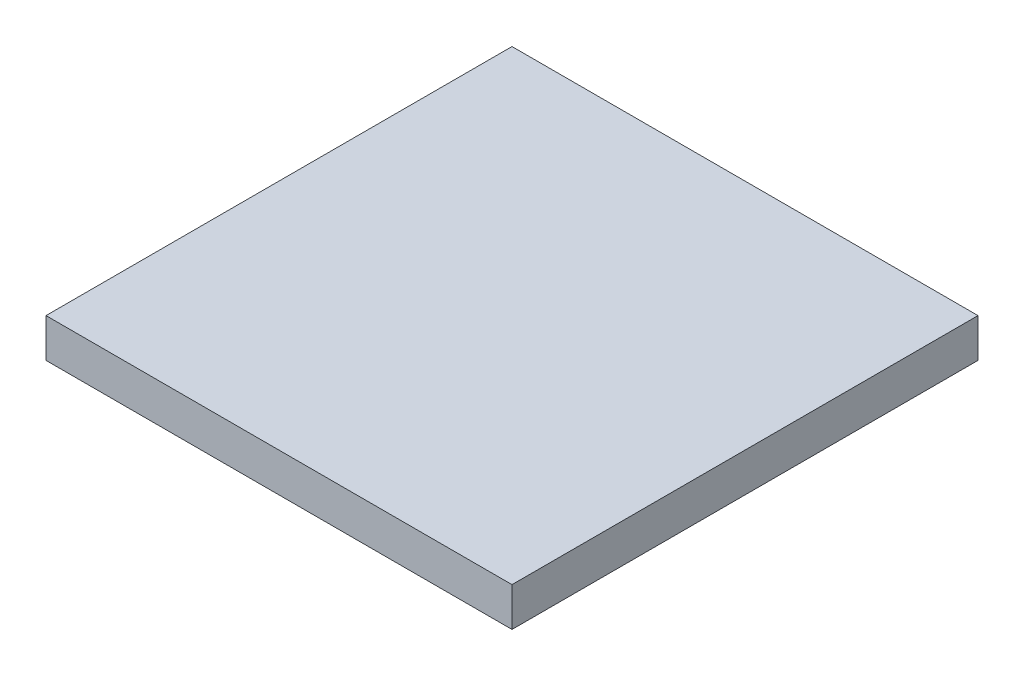
ISO-10303-21;
HEADER;
FILE_DESCRIPTION(('STEP AP214'),'2;1');
FILE_NAME('part.step','',(''),(''),'','','');
FILE_SCHEMA(('AUTOMOTIVE_DESIGN { 1 0 10303 214 1 1 1 1 }'));
ENDSEC;
DATA;
#1=APPLICATION_CONTEXT('core data for automotive mechanical design processes');
#2=APPLICATION_PROTOCOL_DEFINITION('international standard','automotive_design',2000,#1);
#3=PRODUCT_CONTEXT('',#1,'mechanical');
#4=PRODUCT('Part','Part','',(#3));
#5=PRODUCT_RELATED_PRODUCT_CATEGORY('part','',(#4));
#6=PRODUCT_DEFINITION_FORMATION('','',#4);
#7=PRODUCT_DEFINITION_CONTEXT('part definition',#1,'design');
#8=PRODUCT_DEFINITION('design','',#6,#7);
#9=PRODUCT_DEFINITION_SHAPE('','',#8);
#10=(LENGTH_UNIT() NAMED_UNIT(*) SI_UNIT(.MILLI.,.METRE.));
#11=(NAMED_UNIT(*) PLANE_ANGLE_UNIT() SI_UNIT($,.RADIAN.));
#12=(NAMED_UNIT(*) SI_UNIT($,.STERADIAN.) SOLID_ANGLE_UNIT());
#13=UNCERTAINTY_MEASURE_WITH_UNIT(LENGTH_MEASURE(1.E-05),#10,'distance_accuracy_value','');
#14=(GEOMETRIC_REPRESENTATION_CONTEXT(3) GLOBAL_UNCERTAINTY_ASSIGNED_CONTEXT((#13)) GLOBAL_UNIT_ASSIGNED_CONTEXT((#10,
#11,#12)) REPRESENTATION_CONTEXT('',''));
#15=CARTESIAN_POINT('',(0.,0.,0.));
#16=DIRECTION('',(0.,0.,1.));
#17=DIRECTION('',(1.,0.,0.));
#18=AXIS2_PLACEMENT_3D('',#15,#16,#17);
#19=CARTESIAN_POINT('',(0.,0.,0.));
#20=DIRECTION('',(0.,1.,0.));
#21=DIRECTION('',(0.,0.,1.));
#22=AXIS2_PLACEMENT_3D('',#19,#20,#21);
#23=PLANE('',#22);
#24=DIRECTION('',(-1.,0.,0.));
#25=VECTOR('',#24,1.);
#26=CARTESIAN_POINT('',(-0.6,0.,0.6));
#27=LINE('',#26,#25);
#28=CARTESIAN_POINT('',(0.6,0.,0.6));
#29=VERTEX_POINT('',#28);
#30=CARTESIAN_POINT('',(-0.6,0.,0.6));
#31=VERTEX_POINT('',#30);
#32=EDGE_CURVE('E81',#29,#31,#27,.T.);
#33=ORIENTED_EDGE('',*,*,#32,.T.);
#34=DIRECTION('',(0.,0.,-1.));
#35=VECTOR('',#34,1.);
#36=CARTESIAN_POINT('',(-0.6,0.,-0.6));
#37=LINE('',#36,#35);
#38=CARTESIAN_POINT('',(-0.6,0.,-0.6));
#39=VERTEX_POINT('',#38);
#40=EDGE_CURVE('E68',#31,#39,#37,.T.);
#41=ORIENTED_EDGE('',*,*,#40,.T.);
#42=DIRECTION('',(1.,0.,0.));
#43=VECTOR('',#42,1.);
#44=CARTESIAN_POINT('',(-0.6,0.,-0.6));
#45=LINE('',#44,#43);
#46=CARTESIAN_POINT('',(0.6,0.,-0.6));
#47=VERTEX_POINT('',#46);
#48=EDGE_CURVE('E55',#39,#47,#45,.T.);
#49=ORIENTED_EDGE('',*,*,#48,.T.);
#50=DIRECTION('',(0.,0.,1.));
#51=VECTOR('',#50,1.);
#52=CARTESIAN_POINT('',(0.6,0.,-0.6));
#53=LINE('',#52,#51);
#54=EDGE_CURVE('E20',#47,#29,#53,.T.);
#55=ORIENTED_EDGE('',*,*,#54,.T.);
#56=EDGE_LOOP('',(#33,#41,#49,#55));
#57=FACE_BOUND('',#56,.T.);
#58=ADVANCED_FACE('F17',(#57),#23,.F.);
#59=CARTESIAN_POINT('',(0.6,0.1,-0.6));
#60=DIRECTION('',(-1.,0.,0.));
#61=DIRECTION('',(0.,0.,1.));
#62=AXIS2_PLACEMENT_3D('',#59,#60,#61);
#63=PLANE('',#62);
#64=DIRECTION('',(0.,1.,0.));
#65=VECTOR('',#64,1.);
#66=CARTESIAN_POINT('',(0.6,0.1,-0.6));
#67=LINE('',#66,#65);
#68=CARTESIAN_POINT('',(0.6,0.1,-0.6));
#69=VERTEX_POINT('',#68);
#70=EDGE_CURVE('E61',#47,#69,#67,.T.);
#71=ORIENTED_EDGE('',*,*,#70,.T.);
#72=DIRECTION('',(0.,0.,1.));
#73=VECTOR('',#72,1.);
#74=CARTESIAN_POINT('',(0.6,0.1,0.));
#75=LINE('',#74,#73);
#76=CARTESIAN_POINT('',(0.6,0.1,0.6));
#77=VERTEX_POINT('',#76);
#78=EDGE_CURVE('E83',#77,#69,#75,.F.);
#79=ORIENTED_EDGE('',*,*,#78,.F.);
#80=DIRECTION('',(0.,1.,0.));
#81=VECTOR('',#80,1.);
#82=CARTESIAN_POINT('',(0.6,0.1,0.6));
#83=LINE('',#82,#81);
#84=EDGE_CURVE('E64',#77,#29,#83,.F.);
#85=ORIENTED_EDGE('',*,*,#84,.T.);
#86=ORIENTED_EDGE('',*,*,#54,.F.);
#87=EDGE_LOOP('',(#71,#79,#85,#86));
#88=FACE_BOUND('',#87,.T.);
#89=ADVANCED_FACE('F60',(#88),#63,.F.);
#90=CARTESIAN_POINT('',(-0.6,0.1,-0.6));
#91=DIRECTION('',(0.,0.,1.));
#92=DIRECTION('',(1.,0.,0.));
#93=AXIS2_PLACEMENT_3D('',#90,#91,#92);
#94=PLANE('',#93);
#95=DIRECTION('',(0.,1.,0.));
#96=VECTOR('',#95,1.);
#97=CARTESIAN_POINT('',(-0.6,0.1,-0.6));
#98=LINE('',#97,#96);
#99=CARTESIAN_POINT('',(-0.6,0.1,-0.6));
#100=VERTEX_POINT('',#99);
#101=EDGE_CURVE('E70',#39,#100,#98,.T.);
#102=ORIENTED_EDGE('',*,*,#101,.T.);
#103=DIRECTION('',(1.,0.,0.));
#104=VECTOR('',#103,1.);
#105=CARTESIAN_POINT('',(0.,0.1,-0.6));
#106=LINE('',#105,#104);
#107=EDGE_CURVE('E74',#69,#100,#106,.F.);
#108=ORIENTED_EDGE('',*,*,#107,.F.);
#109=ORIENTED_EDGE('',*,*,#70,.F.);
#110=ORIENTED_EDGE('',*,*,#48,.F.);
#111=EDGE_LOOP('',(#102,#108,#109,#110));
#112=FACE_BOUND('',#111,.T.);
#113=ADVANCED_FACE('F72',(#112),#94,.F.);
#114=CARTESIAN_POINT('',(-0.6,0.1,-0.6));
#115=DIRECTION('',(1.,0.,0.));
#116=DIRECTION('',(0.,0.,-1.));
#117=AXIS2_PLACEMENT_3D('',#114,#115,#116);
#118=PLANE('',#117);
#119=DIRECTION('',(0.,1.,0.));
#120=VECTOR('',#119,1.);
#121=CARTESIAN_POINT('',(-0.6,0.1,0.6));
#122=LINE('',#121,#120);
#123=CARTESIAN_POINT('',(-0.6,0.1,0.6));
#124=VERTEX_POINT('',#123);
#125=EDGE_CURVE('E35',#31,#124,#122,.T.);
#126=ORIENTED_EDGE('',*,*,#125,.T.);
#127=DIRECTION('',(0.,0.,1.));
#128=VECTOR('',#127,1.);
#129=CARTESIAN_POINT('',(-0.6,0.1,0.));
#130=LINE('',#129,#128);
#131=EDGE_CURVE('E26',#100,#124,#130,.T.);
#132=ORIENTED_EDGE('',*,*,#131,.F.);
#133=ORIENTED_EDGE('',*,*,#101,.F.);
#134=ORIENTED_EDGE('',*,*,#40,.F.);
#135=EDGE_LOOP('',(#126,#132,#133,#134));
#136=FACE_BOUND('',#135,.T.);
#137=ADVANCED_FACE('F89',(#136),#118,.F.);
#138=CARTESIAN_POINT('',(-0.6,0.1,0.6));
#139=DIRECTION('',(0.,0.,-1.));
#140=DIRECTION('',(-1.,0.,0.));
#141=AXIS2_PLACEMENT_3D('',#138,#139,#140);
#142=PLANE('',#141);
#143=ORIENTED_EDGE('',*,*,#84,.F.);
#144=DIRECTION('',(1.,0.,0.));
#145=VECTOR('',#144,1.);
#146=CARTESIAN_POINT('',(0.,0.1,0.6));
#147=LINE('',#146,#145);
#148=EDGE_CURVE('E11',#124,#77,#147,.T.);
#149=ORIENTED_EDGE('',*,*,#148,.F.);
#150=ORIENTED_EDGE('',*,*,#125,.F.);
#151=ORIENTED_EDGE('',*,*,#32,.F.);
#152=EDGE_LOOP('',(#143,#149,#150,#151));
#153=FACE_BOUND('',#152,.T.);
#154=ADVANCED_FACE('F91',(#153),#142,.F.);
#155=CARTESIAN_POINT('',(0.,0.1,0.));
#156=DIRECTION('',(0.,1.,0.));
#157=DIRECTION('',(0.,0.,1.));
#158=AXIS2_PLACEMENT_3D('',#155,#156,#157);
#159=PLANE('',#158);
#160=ORIENTED_EDGE('',*,*,#131,.T.);
#161=ORIENTED_EDGE('',*,*,#148,.T.);
#162=ORIENTED_EDGE('',*,*,#78,.T.);
#163=ORIENTED_EDGE('',*,*,#107,.T.);
#164=EDGE_LOOP('',(#160,#161,#162,#163));
#165=FACE_BOUND('',#164,.T.);
#166=ADVANCED_FACE('F88',(#165),#159,.T.);
#167=CLOSED_SHELL('',(#58,#89,#113,#137,#154,#166));
#168=MANIFOLD_SOLID_BREP('B1',#167);
#169=ADVANCED_BREP_SHAPE_REPRESENTATION('',(#18,#168),#14);
#170=SHAPE_DEFINITION_REPRESENTATION(#9,#169);
ENDSEC;
END-ISO-10303-21;
